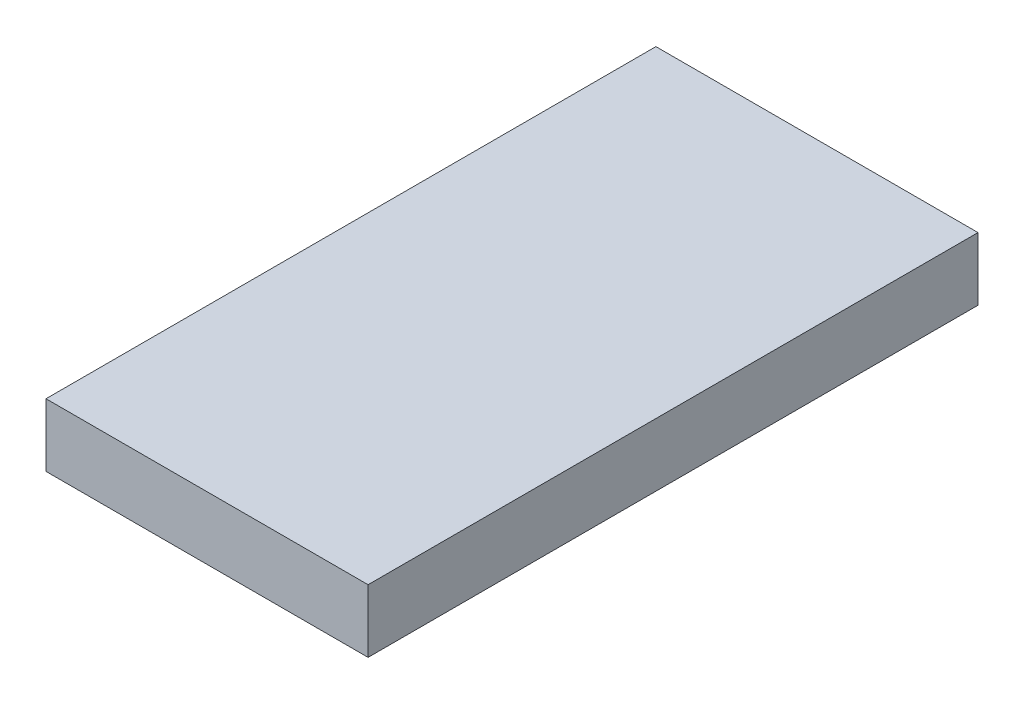
ISO-10303-21;
HEADER;
FILE_DESCRIPTION(('STEP AP214'),'2;1');
FILE_NAME('part.step','',(''),(''),'','','');
FILE_SCHEMA(('AUTOMOTIVE_DESIGN { 1 0 10303 214 1 1 1 1 }'));
ENDSEC;
DATA;
#1=APPLICATION_CONTEXT('core data for automotive mechanical design processes');
#2=APPLICATION_PROTOCOL_DEFINITION('international standard','automotive_design',2000,#1);
#3=PRODUCT_CONTEXT('',#1,'mechanical');
#4=PRODUCT('Part','Part','',(#3));
#5=PRODUCT_RELATED_PRODUCT_CATEGORY('part','',(#4));
#6=PRODUCT_DEFINITION_FORMATION('','',#4);
#7=PRODUCT_DEFINITION_CONTEXT('part definition',#1,'design');
#8=PRODUCT_DEFINITION('design','',#6,#7);
#9=PRODUCT_DEFINITION_SHAPE('','',#8);
#10=(LENGTH_UNIT() NAMED_UNIT(*) SI_UNIT(.MILLI.,.METRE.));
#11=(NAMED_UNIT(*) PLANE_ANGLE_UNIT() SI_UNIT($,.RADIAN.));
#12=(NAMED_UNIT(*) SI_UNIT($,.STERADIAN.) SOLID_ANGLE_UNIT());
#13=UNCERTAINTY_MEASURE_WITH_UNIT(LENGTH_MEASURE(1.E-05),#10,'distance_accuracy_value','');
#14=(GEOMETRIC_REPRESENTATION_CONTEXT(3) GLOBAL_UNCERTAINTY_ASSIGNED_CONTEXT((#13)) GLOBAL_UNIT_ASSIGNED_CONTEXT((#10,
#11,#12)) REPRESENTATION_CONTEXT('',''));
#15=CARTESIAN_POINT('',(0.,0.,0.));
#16=DIRECTION('',(0.,0.,1.));
#17=DIRECTION('',(1.,0.,0.));
#18=AXIS2_PLACEMENT_3D('',#15,#16,#17);
#19=CARTESIAN_POINT('',(17.907,7.,33.909));
#20=DIRECTION('',(-1.,0.,0.));
#21=DIRECTION('',(0.,0.,1.));
#22=AXIS2_PLACEMENT_3D('',#19,#20,#21);
#23=PLANE('',#22);
#24=DIRECTION('',(0.,0.,-1.));
#25=VECTOR('',#24,1.);
#26=CARTESIAN_POINT('',(17.907,0.,33.909));
#27=LINE('',#26,#25);
#28=CARTESIAN_POINT('',(17.907,0.,33.909));
#29=VERTEX_POINT('',#28);
#30=CARTESIAN_POINT('',(17.907,0.,-33.909));
#31=VERTEX_POINT('',#30);
#32=EDGE_CURVE('E96',#29,#31,#27,.T.);
#33=ORIENTED_EDGE('',*,*,#32,.T.);
#34=DIRECTION('',(0.,-1.,0.));
#35=VECTOR('',#34,1.);
#36=CARTESIAN_POINT('',(17.907,7.,-33.909));
#37=LINE('',#36,#35);
#38=CARTESIAN_POINT('',(17.907,7.,-33.909));
#39=VERTEX_POINT('',#38);
#40=EDGE_CURVE('E11',#39,#31,#37,.T.);
#41=ORIENTED_EDGE('',*,*,#40,.F.);
#42=DIRECTION('',(0.,0.,-1.));
#43=VECTOR('',#42,1.);
#44=CARTESIAN_POINT('',(17.907,7.,33.909));
#45=LINE('',#44,#43);
#46=CARTESIAN_POINT('',(17.907,7.,33.909));
#47=VERTEX_POINT('',#46);
#48=EDGE_CURVE('E84',#47,#39,#45,.T.);
#49=ORIENTED_EDGE('',*,*,#48,.F.);
#50=DIRECTION('',(0.,-1.,0.));
#51=VECTOR('',#50,1.);
#52=CARTESIAN_POINT('',(17.907,7.,33.909));
#53=LINE('',#52,#51);
#54=EDGE_CURVE('E92',#47,#29,#53,.T.);
#55=ORIENTED_EDGE('',*,*,#54,.T.);
#56=EDGE_LOOP('',(#33,#41,#49,#55));
#57=FACE_BOUND('',#56,.T.);
#58=ADVANCED_FACE('F33',(#57),#23,.F.);
#59=CARTESIAN_POINT('',(-17.907,7.,-33.909));
#60=DIRECTION('',(0.,0.,1.));
#61=DIRECTION('',(1.,0.,0.));
#62=AXIS2_PLACEMENT_3D('',#59,#60,#61);
#63=PLANE('',#62);
#64=DIRECTION('',(-1.,0.,0.));
#65=VECTOR('',#64,1.);
#66=CARTESIAN_POINT('',(-17.907,0.,-33.909));
#67=LINE('',#66,#65);
#68=CARTESIAN_POINT('',(-17.907,0.,-33.909));
#69=VERTEX_POINT('',#68);
#70=EDGE_CURVE('E88',#31,#69,#67,.T.);
#71=ORIENTED_EDGE('',*,*,#70,.T.);
#72=DIRECTION('',(0.,-1.,0.));
#73=VECTOR('',#72,1.);
#74=CARTESIAN_POINT('',(-17.907,7.,-33.909));
#75=LINE('',#74,#73);
#76=CARTESIAN_POINT('',(-17.907,7.,-33.909));
#77=VERTEX_POINT('',#76);
#78=EDGE_CURVE('E41',#77,#69,#75,.T.);
#79=ORIENTED_EDGE('',*,*,#78,.F.);
#80=DIRECTION('',(-1.,0.,0.));
#81=VECTOR('',#80,1.);
#82=CARTESIAN_POINT('',(-17.907,7.,-33.909));
#83=LINE('',#82,#81);
#84=EDGE_CURVE('E79',#39,#77,#83,.T.);
#85=ORIENTED_EDGE('',*,*,#84,.F.);
#86=ORIENTED_EDGE('',*,*,#40,.T.);
#87=EDGE_LOOP('',(#71,#79,#85,#86));
#88=FACE_BOUND('',#87,.T.);
#89=ADVANCED_FACE('F87',(#88),#63,.F.);
#90=CARTESIAN_POINT('',(-17.907,7.,33.909));
#91=DIRECTION('',(1.,0.,0.));
#92=DIRECTION('',(0.,0.,-1.));
#93=AXIS2_PLACEMENT_3D('',#90,#91,#92);
#94=PLANE('',#93);
#95=DIRECTION('',(0.,0.,1.));
#96=VECTOR('',#95,1.);
#97=CARTESIAN_POINT('',(-17.907,0.,33.909));
#98=LINE('',#97,#96);
#99=CARTESIAN_POINT('',(-17.907,0.,33.909));
#100=VERTEX_POINT('',#99);
#101=EDGE_CURVE('E66',#69,#100,#98,.T.);
#102=ORIENTED_EDGE('',*,*,#101,.T.);
#103=DIRECTION('',(0.,-1.,0.));
#104=VECTOR('',#103,1.);
#105=CARTESIAN_POINT('',(-17.907,7.,33.909));
#106=LINE('',#105,#104);
#107=CARTESIAN_POINT('',(-17.907,7.,33.909));
#108=VERTEX_POINT('',#107);
#109=EDGE_CURVE('E89',#108,#100,#106,.T.);
#110=ORIENTED_EDGE('',*,*,#109,.F.);
#111=DIRECTION('',(0.,0.,1.));
#112=VECTOR('',#111,1.);
#113=CARTESIAN_POINT('',(-17.907,7.,33.909));
#114=LINE('',#113,#112);
#115=EDGE_CURVE('E82',#77,#108,#114,.T.);
#116=ORIENTED_EDGE('',*,*,#115,.F.);
#117=ORIENTED_EDGE('',*,*,#78,.T.);
#118=EDGE_LOOP('',(#102,#110,#116,#117));
#119=FACE_BOUND('',#118,.T.);
#120=ADVANCED_FACE('F90',(#119),#94,.F.);
#121=CARTESIAN_POINT('',(-17.907,7.,33.909));
#122=DIRECTION('',(0.,0.,-1.));
#123=DIRECTION('',(-1.,0.,0.));
#124=AXIS2_PLACEMENT_3D('',#121,#122,#123);
#125=PLANE('',#124);
#126=DIRECTION('',(1.,0.,0.));
#127=VECTOR('',#126,1.);
#128=CARTESIAN_POINT('',(-17.907,0.,33.909));
#129=LINE('',#128,#127);
#130=EDGE_CURVE('E72',#100,#29,#129,.T.);
#131=ORIENTED_EDGE('',*,*,#130,.T.);
#132=ORIENTED_EDGE('',*,*,#54,.F.);
#133=DIRECTION('',(1.,0.,0.));
#134=VECTOR('',#133,1.);
#135=CARTESIAN_POINT('',(-17.907,7.,33.909));
#136=LINE('',#135,#134);
#137=EDGE_CURVE('E49',#108,#47,#136,.T.);
#138=ORIENTED_EDGE('',*,*,#137,.F.);
#139=ORIENTED_EDGE('',*,*,#109,.T.);
#140=EDGE_LOOP('',(#131,#132,#138,#139));
#141=FACE_BOUND('',#140,.T.);
#142=ADVANCED_FACE('F103',(#141),#125,.F.);
#143=CARTESIAN_POINT('',(17.907,7.,-33.909));
#144=DIRECTION('',(0.,-1.,0.));
#145=DIRECTION('',(0.,0.,-1.));
#146=AXIS2_PLACEMENT_3D('',#143,#144,#145);
#147=PLANE('',#146);
#148=ORIENTED_EDGE('',*,*,#48,.T.);
#149=ORIENTED_EDGE('',*,*,#84,.T.);
#150=ORIENTED_EDGE('',*,*,#115,.T.);
#151=ORIENTED_EDGE('',*,*,#137,.T.);
#152=EDGE_LOOP('',(#148,#149,#150,#151));
#153=FACE_BOUND('',#152,.T.);
#154=ADVANCED_FACE('F80',(#153),#147,.F.);
#155=CARTESIAN_POINT('',(17.907,0.,-33.909));
#156=DIRECTION('',(0.,-1.,0.));
#157=DIRECTION('',(0.,0.,-1.));
#158=AXIS2_PLACEMENT_3D('',#155,#156,#157);
#159=PLANE('',#158);
#160=ORIENTED_EDGE('',*,*,#32,.F.);
#161=ORIENTED_EDGE('',*,*,#130,.F.);
#162=ORIENTED_EDGE('',*,*,#101,.F.);
#163=ORIENTED_EDGE('',*,*,#70,.F.);
#164=EDGE_LOOP('',(#160,#161,#162,#163));
#165=FACE_BOUND('',#164,.T.);
#166=ADVANCED_FACE('F106',(#165),#159,.T.);
#167=CLOSED_SHELL('',(#58,#89,#120,#142,#154,#166));
#168=MANIFOLD_SOLID_BREP('B2',#167);
#169=ADVANCED_BREP_SHAPE_REPRESENTATION('',(#18,#168),#14);
#170=SHAPE_DEFINITION_REPRESENTATION(#9,#169);
ENDSEC;
END-ISO-10303-21;
